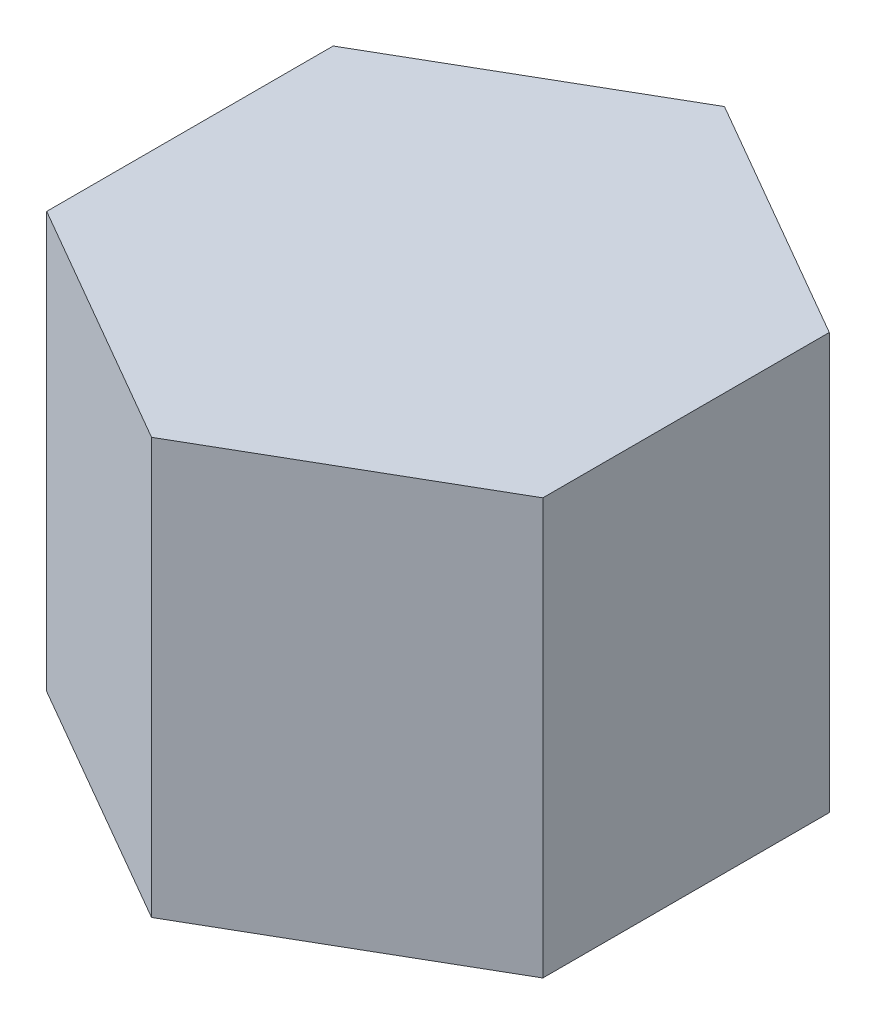
ISO-10303-21;
HEADER;
FILE_DESCRIPTION(('STEP AP214'),'2;1');
FILE_NAME('part.step','',(''),(''),'','','');
FILE_SCHEMA(('AUTOMOTIVE_DESIGN { 1 0 10303 214 1 1 1 1 }'));
ENDSEC;
DATA;
#1=APPLICATION_CONTEXT('core data for automotive mechanical design processes');
#2=APPLICATION_PROTOCOL_DEFINITION('international standard','automotive_design',2000,#1);
#3=PRODUCT_CONTEXT('',#1,'mechanical');
#4=PRODUCT('Part','Part','',(#3));
#5=PRODUCT_RELATED_PRODUCT_CATEGORY('part','',(#4));
#6=PRODUCT_DEFINITION_FORMATION('','',#4);
#7=PRODUCT_DEFINITION_CONTEXT('part definition',#1,'design');
#8=PRODUCT_DEFINITION('design','',#6,#7);
#9=PRODUCT_DEFINITION_SHAPE('','',#8);
#10=(LENGTH_UNIT() NAMED_UNIT(*) SI_UNIT(.MILLI.,.METRE.));
#11=(NAMED_UNIT(*) PLANE_ANGLE_UNIT() SI_UNIT($,.RADIAN.));
#12=(NAMED_UNIT(*) SI_UNIT($,.STERADIAN.) SOLID_ANGLE_UNIT());
#13=UNCERTAINTY_MEASURE_WITH_UNIT(LENGTH_MEASURE(1.E-05),#10,'distance_accuracy_value','');
#14=(GEOMETRIC_REPRESENTATION_CONTEXT(3) GLOBAL_UNCERTAINTY_ASSIGNED_CONTEXT((#13)) GLOBAL_UNIT_ASSIGNED_CONTEXT((#10,
#11,#12)) REPRESENTATION_CONTEXT('',''));
#15=CARTESIAN_POINT('',(0.,0.,0.));
#16=DIRECTION('',(0.,0.,1.));
#17=DIRECTION('',(1.,0.,0.));
#18=AXIS2_PLACEMENT_3D('',#15,#16,#17);
#19=CARTESIAN_POINT('',(202.642660308706,-148.537700895744,294.971072835632));
#20=DIRECTION('',(-0.499999999999943,0.,-0.866025403784472));
#21=DIRECTION('',(-0.866025403784472,0.,0.499999999999943));
#22=AXIS2_PLACEMENT_3D('',#19,#20,#21);
#23=PLANE('',#22);
#24=CARTESIAN_POINT('',(202.339551417381,-149.045793579175,295.146072835632));
#25=DIRECTION('',(0.866025403784471,0.,-0.499999999999943));
#26=VECTOR('',#25,1.);
#27=LINE('',#24,#26);
#28=CARTESIAN_POINT('',(202.339551417382,-149.045793579175,295.146072835632));
#29=VERTEX_POINT('',#28);
#30=CARTESIAN_POINT('',(202.642660308706,-149.045793579175,294.971072835632));
#31=VERTEX_POINT('',#30);
#32=EDGE_CURVE('E170',#29,#31,#27,.T.);
#33=ORIENTED_EDGE('',*,*,#32,.T.);
#34=CARTESIAN_POINT('',(202.642660308706,-148.537700895744,294.971072835632));
#35=DIRECTION('',(0.,-1.,0.));
#36=VECTOR('',#35,1.);
#37=LINE('',#34,#36);
#38=CARTESIAN_POINT('',(202.642660308706,-148.537700895744,294.971072835632));
#39=VERTEX_POINT('',#38);
#40=EDGE_CURVE('E35',#39,#31,#37,.T.);
#41=ORIENTED_EDGE('',*,*,#40,.F.);
#42=CARTESIAN_POINT('',(202.339551417381,-148.537700895744,295.146072835632));
#43=DIRECTION('',(0.866025403784471,0.,-0.499999999999943));
#44=VECTOR('',#43,1.);
#45=LINE('',#42,#44);
#46=CARTESIAN_POINT('',(202.339551417382,-148.537700895744,295.146072835632));
#47=VERTEX_POINT('',#46);
#48=EDGE_CURVE('E159',#47,#39,#45,.T.);
#49=ORIENTED_EDGE('',*,*,#48,.F.);
#50=CARTESIAN_POINT('',(202.339551417381,-148.537700895744,295.146072835632));
#51=DIRECTION('',(0.,-1.,0.));
#52=VECTOR('',#51,1.);
#53=LINE('',#50,#52);
#54=EDGE_CURVE('E10',#47,#29,#53,.T.);
#55=ORIENTED_EDGE('',*,*,#54,.T.);
#56=EDGE_LOOP('',(#33,#41,#49,#55));
#57=FACE_BOUND('',#56,.T.);
#58=ADVANCED_FACE('F16',(#57),#23,.F.);
#59=CARTESIAN_POINT('',(202.339551417382,-148.537700895744,295.146072835632));
#60=DIRECTION('',(0.499999999999978,0.,-0.866025403784452));
#61=DIRECTION('',(-0.866025403784452,0.,-0.499999999999978));
#62=AXIS2_PLACEMENT_3D('',#59,#60,#61);
#63=PLANE('',#62);
#64=CARTESIAN_POINT('',(202.036442526057,-149.045793579175,294.971072835632));
#65=DIRECTION('',(0.866025403784452,0.,0.499999999999978));
#66=VECTOR('',#65,1.);
#67=LINE('',#64,#66);
#68=CARTESIAN_POINT('',(202.036442526057,-149.045793579175,294.971072835632));
#69=VERTEX_POINT('',#68);
#70=EDGE_CURVE('E167',#69,#29,#67,.T.);
#71=ORIENTED_EDGE('',*,*,#70,.T.);
#72=ORIENTED_EDGE('',*,*,#54,.F.);
#73=CARTESIAN_POINT('',(202.036442526057,-148.537700895744,294.971072835632));
#74=DIRECTION('',(0.866025403784452,0.,0.499999999999978));
#75=VECTOR('',#74,1.);
#76=LINE('',#73,#75);
#77=CARTESIAN_POINT('',(202.036442526057,-148.537700895744,294.971072835632));
#78=VERTEX_POINT('',#77);
#79=EDGE_CURVE('E156',#78,#47,#76,.T.);
#80=ORIENTED_EDGE('',*,*,#79,.F.);
#81=CARTESIAN_POINT('',(202.036442526057,-148.537700895744,294.971072835632));
#82=DIRECTION('',(0.,-1.,0.));
#83=VECTOR('',#82,1.);
#84=LINE('',#81,#83);
#85=EDGE_CURVE('E27',#78,#69,#84,.T.);
#86=ORIENTED_EDGE('',*,*,#85,.T.);
#87=EDGE_LOOP('',(#71,#72,#80,#86));
#88=FACE_BOUND('',#87,.T.);
#89=ADVANCED_FACE('F189',(#88),#63,.F.);
#90=CARTESIAN_POINT('',(202.036442526057,-148.537700895744,290.831971220494));
#91=DIRECTION('',(1.,0.,0.));
#92=DIRECTION('',(0.,1.,0.));
#93=AXIS2_PLACEMENT_3D('',#90,#91,#92);
#94=PLANE('',#93);
#95=CARTESIAN_POINT('',(202.036442526057,-149.045793579175,294.621072835632));
#96=DIRECTION('',(0.,0.,1.));
#97=VECTOR('',#96,1.);
#98=LINE('',#95,#97);
#99=CARTESIAN_POINT('',(202.036442526057,-149.045793579175,294.621072835632));
#100=VERTEX_POINT('',#99);
#101=EDGE_CURVE('E163',#100,#69,#98,.T.);
#102=ORIENTED_EDGE('',*,*,#101,.T.);
#103=ORIENTED_EDGE('',*,*,#85,.F.);
#104=CARTESIAN_POINT('',(202.036442526057,-148.537700895744,294.621072835632));
#105=DIRECTION('',(0.,0.,1.));
#106=VECTOR('',#105,1.);
#107=LINE('',#104,#106);
#108=CARTESIAN_POINT('',(202.036442526057,-148.537700895744,294.621072835632));
#109=VERTEX_POINT('',#108);
#110=EDGE_CURVE('E106',#109,#78,#107,.T.);
#111=ORIENTED_EDGE('',*,*,#110,.F.);
#112=CARTESIAN_POINT('',(202.036442526057,-148.537700895744,294.621072835632));
#113=DIRECTION('',(0.,-1.,0.));
#114=VECTOR('',#113,1.);
#115=LINE('',#112,#114);
#116=EDGE_CURVE('E94',#109,#100,#115,.T.);
#117=ORIENTED_EDGE('',*,*,#116,.T.);
#118=EDGE_LOOP('',(#102,#103,#111,#117));
#119=FACE_BOUND('',#118,.T.);
#120=ADVANCED_FACE('F198',(#119),#94,.F.);
#121=CARTESIAN_POINT('',(202.036442526057,-148.537700895744,294.621072835632));
#122=DIRECTION('',(0.499999999999978,0.,0.866025403784452));
#123=DIRECTION('',(0.866025403784452,0.,-0.499999999999978));
#124=AXIS2_PLACEMENT_3D('',#121,#122,#123);
#125=PLANE('',#124);
#126=CARTESIAN_POINT('',(202.339551417382,-149.045793579175,294.446072835632));
#127=DIRECTION('',(-0.866025403784452,0.,0.499999999999978));
#128=VECTOR('',#127,1.);
#129=LINE('',#126,#128);
#130=CARTESIAN_POINT('',(202.339551417382,-149.045793579175,294.446072835632));
#131=VERTEX_POINT('',#130);
#132=EDGE_CURVE('E162',#131,#100,#129,.T.);
#133=ORIENTED_EDGE('',*,*,#132,.T.);
#134=ORIENTED_EDGE('',*,*,#116,.F.);
#135=CARTESIAN_POINT('',(202.339551417382,-148.537700895744,294.446072835632));
#136=DIRECTION('',(-0.866025403784452,0.,0.499999999999978));
#137=VECTOR('',#136,1.);
#138=LINE('',#135,#137);
#139=CARTESIAN_POINT('',(202.339551417382,-148.537700895744,294.446072835632));
#140=VERTEX_POINT('',#139);
#141=EDGE_CURVE('E98',#140,#109,#138,.T.);
#142=ORIENTED_EDGE('',*,*,#141,.F.);
#143=CARTESIAN_POINT('',(202.339551417382,-148.537700895744,294.446072835632));
#144=DIRECTION('',(0.,-1.,0.));
#145=VECTOR('',#144,1.);
#146=LINE('',#143,#145);
#147=EDGE_CURVE('E79',#140,#131,#146,.T.);
#148=ORIENTED_EDGE('',*,*,#147,.T.);
#149=EDGE_LOOP('',(#133,#134,#142,#148));
#150=FACE_BOUND('',#149,.T.);
#151=ADVANCED_FACE('F100',(#150),#125,.F.);
#152=CARTESIAN_POINT('',(202.339551417382,-148.537700895744,294.446072835632));
#153=DIRECTION('',(-0.500000000000062,0.,0.866025403784403));
#154=DIRECTION('',(0.866025403784403,0.,0.500000000000062));
#155=AXIS2_PLACEMENT_3D('',#152,#153,#154);
#156=PLANE('',#155);
#157=CARTESIAN_POINT('',(202.642660308706,-149.045793579175,294.621072835632));
#158=DIRECTION('',(-0.866025403784403,0.,-0.500000000000062));
#159=VECTOR('',#158,1.);
#160=LINE('',#157,#159);
#161=CARTESIAN_POINT('',(202.642660308706,-149.045793579175,294.621072835632));
#162=VERTEX_POINT('',#161);
#163=EDGE_CURVE('E88',#162,#131,#160,.T.);
#164=ORIENTED_EDGE('',*,*,#163,.T.);
#165=ORIENTED_EDGE('',*,*,#147,.F.);
#166=CARTESIAN_POINT('',(202.642660308706,-148.537700895744,294.621072835632));
#167=DIRECTION('',(-0.866025403784403,0.,-0.500000000000062));
#168=VECTOR('',#167,1.);
#169=LINE('',#166,#168);
#170=CARTESIAN_POINT('',(202.642660308706,-148.537700895744,294.621072835632));
#171=VERTEX_POINT('',#170);
#172=EDGE_CURVE('E84',#171,#140,#169,.T.);
#173=ORIENTED_EDGE('',*,*,#172,.F.);
#174=CARTESIAN_POINT('',(202.642660308706,-148.537700895744,294.621072835632));
#175=DIRECTION('',(0.,-1.,0.));
#176=VECTOR('',#175,1.);
#177=LINE('',#174,#176);
#178=EDGE_CURVE('E58',#171,#162,#177,.T.);
#179=ORIENTED_EDGE('',*,*,#178,.T.);
#180=EDGE_LOOP('',(#164,#165,#173,#179));
#181=FACE_BOUND('',#180,.T.);
#182=ADVANCED_FACE('F82',(#181),#156,.F.);
#183=CARTESIAN_POINT('',(202.642660308706,-148.537700895744,290.831971220494));
#184=DIRECTION('',(-1.,0.,0.));
#185=DIRECTION('',(0.,-1.,0.));
#186=AXIS2_PLACEMENT_3D('',#183,#184,#185);
#187=PLANE('',#186);
#188=CARTESIAN_POINT('',(202.642660308706,-149.045793579175,294.971072835632));
#189=DIRECTION('',(0.,0.,-1.));
#190=VECTOR('',#189,1.);
#191=LINE('',#188,#190);
#192=EDGE_CURVE('E160',#31,#162,#191,.T.);
#193=ORIENTED_EDGE('',*,*,#192,.T.);
#194=ORIENTED_EDGE('',*,*,#178,.F.);
#195=CARTESIAN_POINT('',(202.642660308706,-148.537700895744,294.971072835632));
#196=DIRECTION('',(0.,0.,-1.));
#197=VECTOR('',#196,1.);
#198=LINE('',#195,#197);
#199=EDGE_CURVE('E112',#39,#171,#198,.T.);
#200=ORIENTED_EDGE('',*,*,#199,.F.);
#201=ORIENTED_EDGE('',*,*,#40,.T.);
#202=EDGE_LOOP('',(#193,#194,#200,#201));
#203=FACE_BOUND('',#202,.T.);
#204=ADVANCED_FACE('F131',(#203),#187,.F.);
#205=CARTESIAN_POINT('',(206.339551417382,-148.537700895744,290.831971220494));
#206=DIRECTION('',(0.,-1.,0.));
#207=DIRECTION('',(1.,0.,0.));
#208=AXIS2_PLACEMENT_3D('',#205,#206,#207);
#209=PLANE('',#208);
#210=ORIENTED_EDGE('',*,*,#48,.T.);
#211=ORIENTED_EDGE('',*,*,#199,.T.);
#212=ORIENTED_EDGE('',*,*,#172,.T.);
#213=ORIENTED_EDGE('',*,*,#141,.T.);
#214=ORIENTED_EDGE('',*,*,#110,.T.);
#215=ORIENTED_EDGE('',*,*,#79,.T.);
#216=EDGE_LOOP('',(#210,#211,#212,#213,#214,#215));
#217=FACE_BOUND('',#216,.T.);
#218=ADVANCED_FACE('F111',(#217),#209,.F.);
#219=CARTESIAN_POINT('',(206.339551417382,-149.045793579175,290.831971220494));
#220=DIRECTION('',(0.,-1.,0.));
#221=DIRECTION('',(1.,0.,0.));
#222=AXIS2_PLACEMENT_3D('',#219,#220,#221);
#223=PLANE('',#222);
#224=ORIENTED_EDGE('',*,*,#32,.F.);
#225=ORIENTED_EDGE('',*,*,#70,.F.);
#226=ORIENTED_EDGE('',*,*,#101,.F.);
#227=ORIENTED_EDGE('',*,*,#132,.F.);
#228=ORIENTED_EDGE('',*,*,#163,.F.);
#229=ORIENTED_EDGE('',*,*,#192,.F.);
#230=EDGE_LOOP('',(#224,#225,#226,#227,#228,#229));
#231=FACE_BOUND('',#230,.T.);
#232=ADVANCED_FACE('F130',(#231),#223,.T.);
#233=CLOSED_SHELL('',(#58,#89,#120,#151,#182,#204,#218,#232));
#234=MANIFOLD_SOLID_BREP('B1',#233);
#235=ADVANCED_BREP_SHAPE_REPRESENTATION('',(#18,#234),#14);
#236=SHAPE_DEFINITION_REPRESENTATION(#9,#235);
ENDSEC;
END-ISO-10303-21;
